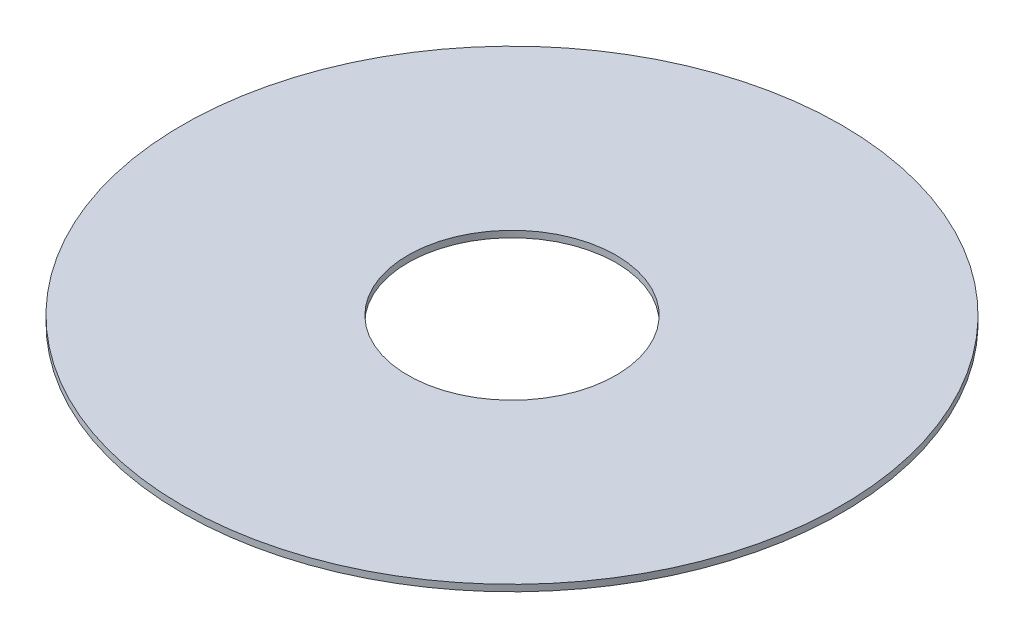
ISO-10303-21;
HEADER;
FILE_DESCRIPTION(('STEP AP214'),'2;1');
FILE_NAME('part.step','',(''),(''),'','','');
FILE_SCHEMA(('AUTOMOTIVE_DESIGN { 1 0 10303 214 1 1 1 1 }'));
ENDSEC;
DATA;
#1=APPLICATION_CONTEXT('core data for automotive mechanical design processes');
#2=APPLICATION_PROTOCOL_DEFINITION('international standard','automotive_design',2000,#1);
#3=PRODUCT_CONTEXT('',#1,'mechanical');
#4=PRODUCT('Part','Part','',(#3));
#5=PRODUCT_RELATED_PRODUCT_CATEGORY('part','',(#4));
#6=PRODUCT_DEFINITION_FORMATION('','',#4);
#7=PRODUCT_DEFINITION_CONTEXT('part definition',#1,'design');
#8=PRODUCT_DEFINITION('design','',#6,#7);
#9=PRODUCT_DEFINITION_SHAPE('','',#8);
#10=(LENGTH_UNIT() NAMED_UNIT(*) SI_UNIT(.MILLI.,.METRE.));
#11=(NAMED_UNIT(*) PLANE_ANGLE_UNIT() SI_UNIT($,.RADIAN.));
#12=(NAMED_UNIT(*) SI_UNIT($,.STERADIAN.) SOLID_ANGLE_UNIT());
#13=UNCERTAINTY_MEASURE_WITH_UNIT(LENGTH_MEASURE(1.E-05),#10,'distance_accuracy_value','');
#14=(GEOMETRIC_REPRESENTATION_CONTEXT(3) GLOBAL_UNCERTAINTY_ASSIGNED_CONTEXT((#13)) GLOBAL_UNIT_ASSIGNED_CONTEXT((#10,
#11,#12)) REPRESENTATION_CONTEXT('',''));
#15=CARTESIAN_POINT('',(0.,0.,0.));
#16=DIRECTION('',(0.,0.,1.));
#17=DIRECTION('',(1.,0.,0.));
#18=AXIS2_PLACEMENT_3D('',#15,#16,#17);
#19=CARTESIAN_POINT('',(0.,-2.38125,0.));
#20=DIRECTION('',(0.,1.,0.));
#21=DIRECTION('',(0.,0.,1.));
#22=AXIS2_PLACEMENT_3D('',#19,#20,#21);
#23=PLANE('',#22);
#24=CARTESIAN_POINT('',(0.,-2.38125,0.));
#25=DIRECTION('',(0.,-1.,0.));
#26=DIRECTION('',(0.,0.,-1.));
#27=AXIS2_PLACEMENT_3D('',#24,#25,#26);
#28=CIRCLE('',#27,76.2);
#29=CARTESIAN_POINT('',(0.,-2.38125,-76.2));
#30=VERTEX_POINT('',#29);
#31=EDGE_CURVE('E27',#30,#30,#28,.F.);
#32=ORIENTED_EDGE('',*,*,#31,.T.);
#33=EDGE_LOOP('',(#32));
#34=FACE_BOUND('',#33,.T.);
#35=CARTESIAN_POINT('',(0.,-2.38125,0.));
#36=DIRECTION('',(0.,-1.,0.));
#37=DIRECTION('',(0.,0.,-1.));
#38=AXIS2_PLACEMENT_3D('',#35,#36,#37);
#39=CIRCLE('',#38,241.3);
#40=CARTESIAN_POINT('',(0.,-2.38125,-241.3));
#41=VERTEX_POINT('',#40);
#42=EDGE_CURVE('E18',#41,#41,#39,.F.);
#43=ORIENTED_EDGE('',*,*,#42,.F.);
#44=EDGE_LOOP('',(#43));
#45=FACE_BOUND('',#44,.T.);
#46=ADVANCED_FACE('F15',(#34,#45),#23,.F.);
#47=CARTESIAN_POINT('',(0.,2.38125,0.));
#48=DIRECTION('',(0.,-1.,0.));
#49=DIRECTION('',(0.,0.,-1.));
#50=AXIS2_PLACEMENT_3D('',#47,#48,#49);
#51=CYLINDRICAL_SURFACE('',#50,241.3);
#52=ORIENTED_EDGE('',*,*,#42,.T.);
#53=EDGE_LOOP('',(#52));
#54=FACE_BOUND('',#53,.T.);
#55=CARTESIAN_POINT('',(0.,2.38125,0.));
#56=DIRECTION('',(0.,-1.,0.));
#57=DIRECTION('',(0.,0.,-1.));
#58=AXIS2_PLACEMENT_3D('',#55,#56,#57);
#59=CIRCLE('',#58,241.3);
#60=CARTESIAN_POINT('',(0.,2.38125,-241.3));
#61=VERTEX_POINT('',#60);
#62=EDGE_CURVE('E22',#61,#61,#59,.F.);
#63=ORIENTED_EDGE('',*,*,#62,.F.);
#64=EDGE_LOOP('',(#63));
#65=FACE_BOUND('',#64,.T.);
#66=ADVANCED_FACE('F35',(#54,#65),#51,.T.);
#67=CARTESIAN_POINT('',(0.,2.38125,0.));
#68=DIRECTION('',(0.,-1.,0.));
#69=DIRECTION('',(0.,0.,-1.));
#70=AXIS2_PLACEMENT_3D('',#67,#68,#69);
#71=CYLINDRICAL_SURFACE('',#70,76.2);
#72=CARTESIAN_POINT('',(0.,2.38125,0.));
#73=DIRECTION('',(0.,-1.,0.));
#74=DIRECTION('',(0.,0.,-1.));
#75=AXIS2_PLACEMENT_3D('',#72,#73,#74);
#76=CIRCLE('',#75,76.2);
#77=CARTESIAN_POINT('',(0.,2.38125,-76.2));
#78=VERTEX_POINT('',#77);
#79=EDGE_CURVE('E10',#78,#78,#76,.T.);
#80=ORIENTED_EDGE('',*,*,#79,.F.);
#81=EDGE_LOOP('',(#80));
#82=FACE_BOUND('',#81,.T.);
#83=ORIENTED_EDGE('',*,*,#31,.F.);
#84=EDGE_LOOP('',(#83));
#85=FACE_BOUND('',#84,.T.);
#86=ADVANCED_FACE('F43',(#82,#85),#71,.F.);
#87=CARTESIAN_POINT('',(0.,2.38125,0.));
#88=DIRECTION('',(0.,1.,0.));
#89=DIRECTION('',(0.,0.,1.));
#90=AXIS2_PLACEMENT_3D('',#87,#88,#89);
#91=PLANE('',#90);
#92=ORIENTED_EDGE('',*,*,#79,.T.);
#93=EDGE_LOOP('',(#92));
#94=FACE_BOUND('',#93,.T.);
#95=ORIENTED_EDGE('',*,*,#62,.T.);
#96=EDGE_LOOP('',(#95));
#97=FACE_BOUND('',#96,.T.);
#98=ADVANCED_FACE('F44',(#94,#97),#91,.T.);
#99=CLOSED_SHELL('',(#46,#66,#86,#98));
#100=MANIFOLD_SOLID_BREP('B1',#99);
#101=ADVANCED_BREP_SHAPE_REPRESENTATION('',(#18,#100),#14);
#102=SHAPE_DEFINITION_REPRESENTATION(#9,#101);
ENDSEC;
END-ISO-10303-21;
